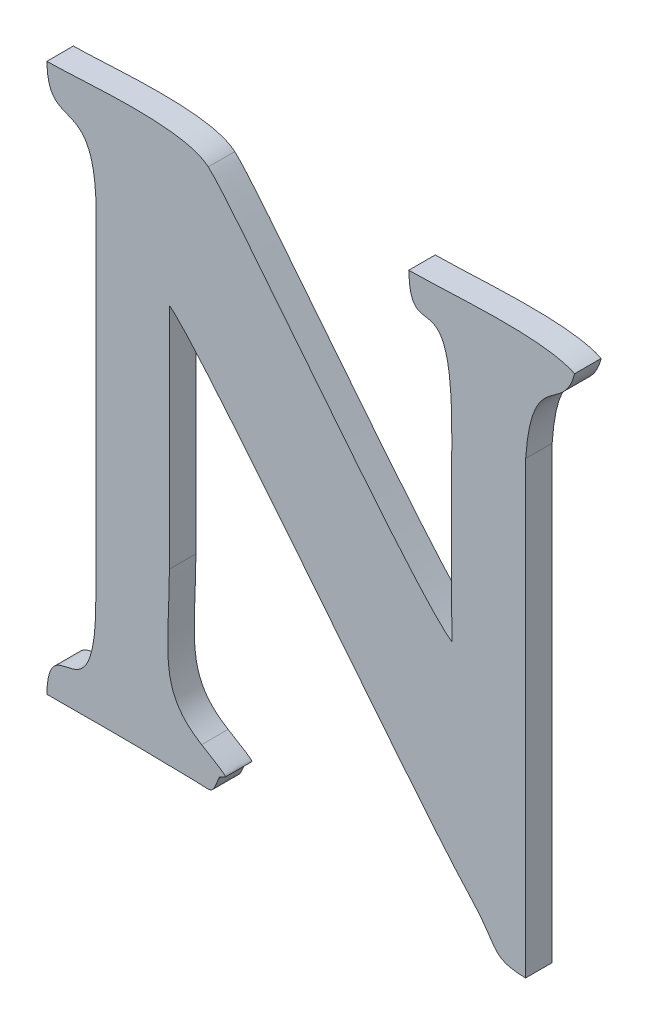
ISO-10303-21;
HEADER;
FILE_DESCRIPTION(('STEP AP214'),'2;1');
FILE_NAME('part.step','',(''),(''),'','','');
FILE_SCHEMA(('AUTOMOTIVE_DESIGN { 1 0 10303 214 1 1 1 1 }'));
ENDSEC;
DATA;
#1=APPLICATION_CONTEXT('core data for automotive mechanical design processes');
#2=APPLICATION_PROTOCOL_DEFINITION('international standard','automotive_design',2000,#1);
#3=PRODUCT_CONTEXT('',#1,'mechanical');
#4=PRODUCT('Part','Part','',(#3));
#5=PRODUCT_RELATED_PRODUCT_CATEGORY('part','',(#4));
#6=PRODUCT_DEFINITION_FORMATION('','',#4);
#7=PRODUCT_DEFINITION_CONTEXT('part definition',#1,'design');
#8=PRODUCT_DEFINITION('design','',#6,#7);
#9=PRODUCT_DEFINITION_SHAPE('','',#8);
#10=(LENGTH_UNIT() NAMED_UNIT(*) SI_UNIT(.MILLI.,.METRE.));
#11=(NAMED_UNIT(*) PLANE_ANGLE_UNIT() SI_UNIT($,.RADIAN.));
#12=(NAMED_UNIT(*) SI_UNIT($,.STERADIAN.) SOLID_ANGLE_UNIT());
#13=UNCERTAINTY_MEASURE_WITH_UNIT(LENGTH_MEASURE(1.E-05),#10,'distance_accuracy_value','');
#14=(GEOMETRIC_REPRESENTATION_CONTEXT(3) GLOBAL_UNCERTAINTY_ASSIGNED_CONTEXT((#13)) GLOBAL_UNIT_ASSIGNED_CONTEXT((#10,
#11,#12)) REPRESENTATION_CONTEXT('',''));
#15=CARTESIAN_POINT('',(0.,0.,0.));
#16=DIRECTION('',(0.,0.,1.));
#17=DIRECTION('',(1.,0.,0.));
#18=AXIS2_PLACEMENT_3D('',#15,#16,#17);
#19=CARTESIAN_POINT('',(50.2821299999998,11.219925,0.001));
#20=CARTESIAN_POINT('',(50.2821299999998,11.219925,0.));
#21=CARTESIAN_POINT('',(50.2821999999998,11.217251,0.001));
#22=CARTESIAN_POINT('',(50.2821999999998,11.217251,0.));
#23=CARTESIAN_POINT('',(50.2837959999998,11.220821,0.001));
#24=CARTESIAN_POINT('',(50.2837959999998,11.220821,0.));
#25=CARTESIAN_POINT('',(50.2837539999998,11.215249,0.001));
#26=CARTESIAN_POINT('',(50.2837539999998,11.215249,0.));
#27=B_SPLINE_SURFACE_WITH_KNOTS('',3,1,((#19,#20),(#21,#22),(#23,#24),(#25,#26)),.UNSPECIFIED.,
.F.,.F.,.F.,(4,4),(2,2),(0.842105263157895,0.894736842105263),(0.,1.),.UNSPECIFIED.);
#28=CARTESIAN_POINT('',(50.2821299999998,11.219925,0.));
#29=CARTESIAN_POINT('',(50.2821999999998,11.217251,0.));
#30=CARTESIAN_POINT('',(50.2837959999998,11.220821,0.));
#31=CARTESIAN_POINT('',(50.2837539999998,11.215249,0.));
#32=B_SPLINE_CURVE_WITH_KNOTS('',3,(#28,#29,#30,#31),.UNSPECIFIED.,.F.,.F.,(4,4),
(0.842105263157895,0.894736842105263),.UNSPECIFIED.);
#33=CARTESIAN_POINT('',(50.2821299999998,11.219925,0.));
#34=VERTEX_POINT('',#33);
#35=CARTESIAN_POINT('',(50.2837539999998,11.215249,0.));
#36=VERTEX_POINT('',#35);
#37=EDGE_CURVE('E11',#34,#36,#32,.T.);
#38=DIRECTION('',(0.,0.,-1.));
#39=VECTOR('',#38,1.);
#40=CARTESIAN_POINT('',(50.2837539999998,11.215249,0.001));
#41=LINE('',#40,#39);
#42=CARTESIAN_POINT('',(50.2837539999998,11.215249,0.001));
#43=VERTEX_POINT('',#42);
#44=EDGE_CURVE('E28',#43,#36,#41,.T.);
#45=CARTESIAN_POINT('',(50.2821299999998,11.219925,0.001));
#46=CARTESIAN_POINT('',(50.2821999999998,11.217251,0.001));
#47=CARTESIAN_POINT('',(50.2837959999998,11.220821,0.001));
#48=CARTESIAN_POINT('',(50.2837539999998,11.215249,0.001));
#49=B_SPLINE_CURVE_WITH_KNOTS('',3,(#45,#46,#47,#48),.UNSPECIFIED.,.F.,.F.,(4,4),
(0.842105263157895,0.894736842105263),.UNSPECIFIED.);
#50=CARTESIAN_POINT('',(50.2821299999998,11.219925,0.001));
#51=VERTEX_POINT('',#50);
#52=EDGE_CURVE('E407',#51,#43,#49,.T.);
#53=DIRECTION('',(0.,0.,-1.));
#54=VECTOR('',#53,1.);
#55=CARTESIAN_POINT('',(50.2821299999998,11.219925,0.001));
#56=LINE('',#55,#54);
#57=EDGE_CURVE('E40',#51,#34,#56,.T.);
#58=ORIENTED_EDGE('',*,*,#37,.T.);
#59=ORIENTED_EDGE('',*,*,#44,.F.);
#60=ORIENTED_EDGE('',*,*,#52,.F.);
#61=ORIENTED_EDGE('',*,*,#57,.T.);
#62=EDGE_LOOP('',(#58,#59,#60,#61));
#63=FACE_BOUND('',#62,.T.);
#64=ADVANCED_FACE('F17',(#63),#27,.F.);
#65=CARTESIAN_POINT('',(50.2837539999998,11.215249,0.001));
#66=CARTESIAN_POINT('',(50.2837539999998,11.215249,0.));
#67=CARTESIAN_POINT('',(50.2837399999998,11.213037,0.001));
#68=CARTESIAN_POINT('',(50.2837399999998,11.213037,0.));
#69=CARTESIAN_POINT('',(50.2837539999998,11.210811,0.001));
#70=CARTESIAN_POINT('',(50.2837539999998,11.210811,0.));
#71=CARTESIAN_POINT('',(50.2837539999998,11.208599,0.001));
#72=CARTESIAN_POINT('',(50.2837539999998,11.208599,0.));
#73=B_SPLINE_SURFACE_WITH_KNOTS('',3,1,((#65,#66),(#67,#68),(#69,#70),(#71,#72)),.UNSPECIFIED.,
.F.,.F.,.F.,(4,4),(2,2),(0.894736842105263,1.),(0.,1.),.UNSPECIFIED.);
#74=CARTESIAN_POINT('',(50.2837539999998,11.215249,0.));
#75=CARTESIAN_POINT('',(50.2837399999998,11.213037,0.));
#76=CARTESIAN_POINT('',(50.2837539999998,11.210811,0.));
#77=CARTESIAN_POINT('',(50.2837539999998,11.208599,0.));
#78=B_SPLINE_CURVE_WITH_KNOTS('',3,(#74,#75,#76,#77),.UNSPECIFIED.,.F.,.F.,(4,4),
(0.894736842105263,1.),.UNSPECIFIED.);
#79=CARTESIAN_POINT('',(50.2837539999998,11.208599,0.));
#80=VERTEX_POINT('',#79);
#81=EDGE_CURVE('E399',#36,#80,#78,.T.);
#82=DIRECTION('',(0.,0.,-1.));
#83=VECTOR('',#82,1.);
#84=CARTESIAN_POINT('',(50.2837539999998,11.208599,0.001));
#85=LINE('',#84,#83);
#86=CARTESIAN_POINT('',(50.2837539999998,11.208599,0.001));
#87=VERTEX_POINT('',#86);
#88=EDGE_CURVE('E394',#87,#80,#85,.T.);
#89=CARTESIAN_POINT('',(50.2837539999998,11.215249,0.001));
#90=CARTESIAN_POINT('',(50.2837399999998,11.213037,0.001));
#91=CARTESIAN_POINT('',(50.2837539999998,11.210811,0.001));
#92=CARTESIAN_POINT('',(50.2837539999998,11.208599,0.001));
#93=B_SPLINE_CURVE_WITH_KNOTS('',3,(#89,#90,#91,#92),.UNSPECIFIED.,.F.,.F.,(4,4),
(0.894736842105263,1.),.UNSPECIFIED.);
#94=EDGE_CURVE('E387',#43,#87,#93,.T.);
#95=ORIENTED_EDGE('',*,*,#81,.T.);
#96=ORIENTED_EDGE('',*,*,#88,.F.);
#97=ORIENTED_EDGE('',*,*,#94,.F.);
#98=ORIENTED_EDGE('',*,*,#44,.T.);
#99=EDGE_LOOP('',(#95,#96,#97,#98));
#100=FACE_BOUND('',#99,.T.);
#101=ADVANCED_FACE('F415',(#100),#73,.F.);
#102=CARTESIAN_POINT('',(50.2837539999998,11.208599,0.001));
#103=CARTESIAN_POINT('',(50.2837539999998,11.208599,0.));
#104=CARTESIAN_POINT('',(50.2822279999998,11.209677,0.001));
#105=CARTESIAN_POINT('',(50.2822279999998,11.209677,0.));
#106=CARTESIAN_POINT('',(50.2755639999998,11.218665,0.001));
#107=CARTESIAN_POINT('',(50.2755639999998,11.218665,0.));
#108=CARTESIAN_POINT('',(50.2745699999998,11.219519,0.001));
#109=CARTESIAN_POINT('',(50.2745699999998,11.219519,0.));
#110=B_SPLINE_SURFACE_WITH_KNOTS('',3,1,((#102,#103),(#104,#105),(#106,#107),(#108,#109)),
.UNSPECIFIED.,.F.,.F.,.F.,(4,4),(2,2),(0.,0.0526315789473684),(0.,1.),.UNSPECIFIED.);
#111=CARTESIAN_POINT('',(50.2837539999998,11.208599,0.));
#112=CARTESIAN_POINT('',(50.2822279999998,11.209677,0.));
#113=CARTESIAN_POINT('',(50.2755639999998,11.218665,0.));
#114=CARTESIAN_POINT('',(50.2745699999998,11.219519,0.));
#115=B_SPLINE_CURVE_WITH_KNOTS('',3,(#111,#112,#113,#114),.UNSPECIFIED.,.F.,.F.,(4,4),(0.,
0.0526315789473684),.UNSPECIFIED.);
#116=CARTESIAN_POINT('',(50.2745699999998,11.219519,0.));
#117=VERTEX_POINT('',#116);
#118=EDGE_CURVE('E382',#80,#117,#115,.T.);
#119=DIRECTION('',(0.,0.,-1.));
#120=VECTOR('',#119,1.);
#121=CARTESIAN_POINT('',(50.2745699999998,11.219519,0.001));
#122=LINE('',#121,#120);
#123=CARTESIAN_POINT('',(50.2745699999998,11.219519,0.001));
#124=VERTEX_POINT('',#123);
#125=EDGE_CURVE('E377',#124,#117,#122,.T.);
#126=CARTESIAN_POINT('',(50.2837539999998,11.208599,0.001));
#127=CARTESIAN_POINT('',(50.2822279999998,11.209677,0.001));
#128=CARTESIAN_POINT('',(50.2755639999998,11.218665,0.001));
#129=CARTESIAN_POINT('',(50.2745699999998,11.219519,0.001));
#130=B_SPLINE_CURVE_WITH_KNOTS('',3,(#126,#127,#128,#129),.UNSPECIFIED.,.F.,.F.,(4,4),(0.,
0.0526315789473684),.UNSPECIFIED.);
#131=EDGE_CURVE('E370',#87,#124,#130,.T.);
#132=ORIENTED_EDGE('',*,*,#118,.T.);
#133=ORIENTED_EDGE('',*,*,#125,.F.);
#134=ORIENTED_EDGE('',*,*,#131,.F.);
#135=ORIENTED_EDGE('',*,*,#88,.T.);
#136=EDGE_LOOP('',(#132,#133,#134,#135));
#137=FACE_BOUND('',#136,.T.);
#138=ADVANCED_FACE('F420',(#137),#110,.F.);
#139=CARTESIAN_POINT('',(50.2745699999998,11.219519,0.000999999999999998));
#140=CARTESIAN_POINT('',(50.2745699999998,11.219519,0.));
#141=CARTESIAN_POINT('',(50.2735899999998,11.220359,0.000999999999999998));
#142=CARTESIAN_POINT('',(50.2735899999998,11.220359,0.));
#143=CARTESIAN_POINT('',(50.2699219999998,11.219925,0.000999999999999998));
#144=CARTESIAN_POINT('',(50.2699219999998,11.219925,0.));
#145=CARTESIAN_POINT('',(50.2684799999998,11.219925,0.000999999999999998));
#146=CARTESIAN_POINT('',(50.2684799999998,11.219925,0.));
#147=B_SPLINE_SURFACE_WITH_KNOTS('',3,1,((#139,#140),(#141,#142),(#143,#144),(#145,#146)),
.UNSPECIFIED.,.F.,.F.,.F.,(4,4),(2,2),(0.0526315789473684,0.105263157894737),(0.,1.),.UNSPECIFIED.);
#148=CARTESIAN_POINT('',(50.2745699999998,11.219519,0.));
#149=CARTESIAN_POINT('',(50.2735899999998,11.220359,0.));
#150=CARTESIAN_POINT('',(50.2699219999998,11.219925,0.));
#151=CARTESIAN_POINT('',(50.2684799999998,11.219925,0.));
#152=B_SPLINE_CURVE_WITH_KNOTS('',3,(#148,#149,#150,#151),.UNSPECIFIED.,.F.,.F.,(4,4),
(0.0526315789473684,0.105263157894737),.UNSPECIFIED.);
#153=CARTESIAN_POINT('',(50.2684799999998,11.219925,0.));
#154=VERTEX_POINT('',#153);
#155=EDGE_CURVE('E365',#117,#154,#152,.T.);
#156=DIRECTION('',(0.,0.,-1.));
#157=VECTOR('',#156,1.);
#158=CARTESIAN_POINT('',(50.2684799999998,11.219925,0.000999999999999998));
#159=LINE('',#158,#157);
#160=CARTESIAN_POINT('',(50.2684799999998,11.219925,0.000999999999999998));
#161=VERTEX_POINT('',#160);
#162=EDGE_CURVE('E360',#161,#154,#159,.T.);
#163=CARTESIAN_POINT('',(50.2745699999998,11.219519,0.001));
#164=CARTESIAN_POINT('',(50.2735899999998,11.220359,0.000999999999999998));
#165=CARTESIAN_POINT('',(50.2699219999998,11.219925,0.000999999999999998));
#166=CARTESIAN_POINT('',(50.2684799999998,11.219925,0.000999999999999998));
#167=B_SPLINE_CURVE_WITH_KNOTS('',3,(#163,#164,#165,#166),.UNSPECIFIED.,.F.,.F.,(4,4),
(0.0526315789473684,0.105263157894737),.UNSPECIFIED.);
#168=EDGE_CURVE('E353',#124,#161,#167,.T.);
#169=ORIENTED_EDGE('',*,*,#155,.T.);
#170=ORIENTED_EDGE('',*,*,#162,.F.);
#171=ORIENTED_EDGE('',*,*,#168,.F.);
#172=ORIENTED_EDGE('',*,*,#125,.T.);
#173=EDGE_LOOP('',(#169,#170,#171,#172));
#174=FACE_BOUND('',#173,.T.);
#175=ADVANCED_FACE('F426',(#174),#147,.F.);
#176=CARTESIAN_POINT('',(50.2684799999998,11.219925,0.001));
#177=CARTESIAN_POINT('',(50.2684799999998,11.219925,0.));
#178=CARTESIAN_POINT('',(50.2685219999998,11.217503,0.001));
#179=CARTESIAN_POINT('',(50.2685219999998,11.217503,0.));
#180=CARTESIAN_POINT('',(50.2703559999998,11.219953,0.001));
#181=CARTESIAN_POINT('',(50.2703559999998,11.219953,0.));
#182=CARTESIAN_POINT('',(50.2703419999998,11.215753,0.001));
#183=CARTESIAN_POINT('',(50.2703419999998,11.215753,0.));
#184=B_SPLINE_SURFACE_WITH_KNOTS('',3,1,((#176,#177),(#178,#179),(#180,#181),(#182,#183)),
.UNSPECIFIED.,.F.,.F.,.F.,(4,4),(2,2),(0.105263157894737,0.157894736842105),(0.,1.),.UNSPECIFIED.);
#185=CARTESIAN_POINT('',(50.2684799999998,11.219925,0.));
#186=CARTESIAN_POINT('',(50.2685219999998,11.217503,0.));
#187=CARTESIAN_POINT('',(50.2703559999998,11.219953,0.));
#188=CARTESIAN_POINT('',(50.2703419999998,11.215753,0.));
#189=B_SPLINE_CURVE_WITH_KNOTS('',3,(#185,#186,#187,#188),.UNSPECIFIED.,.F.,.F.,(4,4),
(0.105263157894737,0.157894736842105),.UNSPECIFIED.);
#190=CARTESIAN_POINT('',(50.2703419999998,11.215753,0.));
#191=VERTEX_POINT('',#190);
#192=EDGE_CURVE('E348',#154,#191,#189,.T.);
#193=DIRECTION('',(0.,0.,-1.));
#194=VECTOR('',#193,1.);
#195=CARTESIAN_POINT('',(50.2703419999998,11.215753,0.001));
#196=LINE('',#195,#194);
#197=CARTESIAN_POINT('',(50.2703419999998,11.215753,0.001));
#198=VERTEX_POINT('',#197);
#199=EDGE_CURVE('E343',#198,#191,#196,.T.);
#200=CARTESIAN_POINT('',(50.2684799999998,11.219925,0.000999999999999998));
#201=CARTESIAN_POINT('',(50.2685219999998,11.217503,0.001));
#202=CARTESIAN_POINT('',(50.2703559999998,11.219953,0.001));
#203=CARTESIAN_POINT('',(50.2703419999998,11.215753,0.001));
#204=B_SPLINE_CURVE_WITH_KNOTS('',3,(#200,#201,#202,#203),.UNSPECIFIED.,.F.,.F.,(4,4),
(0.105263157894737,0.157894736842105),.UNSPECIFIED.);
#205=EDGE_CURVE('E339',#161,#198,#204,.T.);
#206=ORIENTED_EDGE('',*,*,#192,.T.);
#207=ORIENTED_EDGE('',*,*,#199,.F.);
#208=ORIENTED_EDGE('',*,*,#205,.F.);
#209=ORIENTED_EDGE('',*,*,#162,.T.);
#210=EDGE_LOOP('',(#206,#207,#208,#209));
#211=FACE_BOUND('',#210,.T.);
#212=ADVANCED_FACE('F430',(#211),#184,.F.);
#213=CARTESIAN_POINT('',(50.2575319274578,-0.0571108317623086,0.001));
#214=DIRECTION('',(0.999999354339468,-0.001136362903187,0.));
#215=DIRECTION('',(0.001136362903187,0.999999354339468,0.));
#216=AXIS2_PLACEMENT_3D('',#213,#214,#215);
#217=PLANE('',#216);
#218=DIRECTION('',(-0.001136362903187,-0.999999354339468,0.));
#219=VECTOR('',#218,1.);
#220=CARTESIAN_POINT('',(50.2575319274578,-0.0571108317623086,0.));
#221=LINE('',#220,#219);
#222=CARTESIAN_POINT('',(50.2703279999998,11.203433,0.));
#223=VERTEX_POINT('',#222);
#224=EDGE_CURVE('E337',#191,#223,#221,.T.);
#225=ORIENTED_EDGE('',*,*,#224,.T.);
#226=DIRECTION('',(0.,0.,-1.));
#227=VECTOR('',#226,1.);
#228=CARTESIAN_POINT('',(50.2703279999998,11.203433,0.001));
#229=LINE('',#228,#227);
#230=CARTESIAN_POINT('',(50.2703279999998,11.203433,0.001));
#231=VERTEX_POINT('',#230);
#232=EDGE_CURVE('E334',#231,#223,#229,.T.);
#233=ORIENTED_EDGE('',*,*,#232,.F.);
#234=DIRECTION('',(-0.001136362903187,-0.999999354339468,0.));
#235=VECTOR('',#234,1.);
#236=CARTESIAN_POINT('',(50.2575319274578,-0.0571108317623086,0.001));
#237=LINE('',#236,#235);
#238=EDGE_CURVE('E328',#198,#231,#237,.T.);
#239=ORIENTED_EDGE('',*,*,#238,.F.);
#240=ORIENTED_EDGE('',*,*,#199,.T.);
#241=EDGE_LOOP('',(#225,#233,#239,#240));
#242=FACE_BOUND('',#241,.T.);
#243=ADVANCED_FACE('F434',(#242),#217,.F.);
#244=CARTESIAN_POINT('',(50.2703279999998,11.203433,0.001));
#245=CARTESIAN_POINT('',(50.2703279999998,11.203433,0.));
#246=CARTESIAN_POINT('',(50.2703699999998,11.198743,0.001));
#247=CARTESIAN_POINT('',(50.2703699999998,11.198743,0.));
#248=CARTESIAN_POINT('',(50.2685359999998,11.201851,0.001));
#249=CARTESIAN_POINT('',(50.2685359999998,11.201851,0.));
#250=CARTESIAN_POINT('',(50.2684799999998,11.199247,0.001));
#251=CARTESIAN_POINT('',(50.2684799999998,11.199247,0.));
#252=B_SPLINE_SURFACE_WITH_KNOTS('',3,1,((#244,#245),(#246,#247),(#248,#249),(#250,#251)),
.UNSPECIFIED.,.F.,.F.,.F.,(4,4),(2,2),(0.210526315789474,0.263157894736842),(0.,1.),.UNSPECIFIED.);
#253=CARTESIAN_POINT('',(50.2703279999998,11.203433,0.));
#254=CARTESIAN_POINT('',(50.2703699999998,11.198743,0.));
#255=CARTESIAN_POINT('',(50.2685359999998,11.201851,0.));
#256=CARTESIAN_POINT('',(50.2684799999998,11.199247,0.));
#257=B_SPLINE_CURVE_WITH_KNOTS('',3,(#253,#254,#255,#256),.UNSPECIFIED.,.F.,.F.,(4,4),
(0.210526315789474,0.263157894736842),.UNSPECIFIED.);
#258=CARTESIAN_POINT('',(50.2684799999998,11.199247,0.));
#259=VERTEX_POINT('',#258);
#260=EDGE_CURVE('E323',#223,#259,#257,.T.);
#261=DIRECTION('',(0.,0.,-1.));
#262=VECTOR('',#261,1.);
#263=CARTESIAN_POINT('',(50.2684799999998,11.199247,0.001));
#264=LINE('',#263,#262);
#265=CARTESIAN_POINT('',(50.2684799999998,11.199247,0.001));
#266=VERTEX_POINT('',#265);
#267=EDGE_CURVE('E318',#266,#259,#264,.T.);
#268=CARTESIAN_POINT('',(50.2703279999998,11.203433,0.001));
#269=CARTESIAN_POINT('',(50.2703699999998,11.198743,0.001));
#270=CARTESIAN_POINT('',(50.2685359999998,11.201851,0.001));
#271=CARTESIAN_POINT('',(50.2684799999998,11.199247,0.001));
#272=B_SPLINE_CURVE_WITH_KNOTS('',3,(#268,#269,#270,#271),.UNSPECIFIED.,.F.,.F.,(4,4),
(0.210526315789474,0.263157894736842),.UNSPECIFIED.);
#273=EDGE_CURVE('E311',#231,#266,#272,.T.);
#274=ORIENTED_EDGE('',*,*,#260,.T.);
#275=ORIENTED_EDGE('',*,*,#267,.F.);
#276=ORIENTED_EDGE('',*,*,#273,.F.);
#277=ORIENTED_EDGE('',*,*,#232,.T.);
#278=EDGE_LOOP('',(#274,#275,#276,#277));
#279=FACE_BOUND('',#278,.T.);
#280=ADVANCED_FACE('F438',(#279),#252,.F.);
#281=CARTESIAN_POINT('',(50.2684799999998,11.199247,0.001));
#282=CARTESIAN_POINT('',(50.2684799999998,11.199247,0.));
#283=CARTESIAN_POINT('',(50.2696279999998,11.199247,0.001));
#284=CARTESIAN_POINT('',(50.2696279999998,11.199247,0.));
#285=CARTESIAN_POINT('',(50.2707899999998,11.199261,0.001));
#286=CARTESIAN_POINT('',(50.2707899999998,11.199261,0.));
#287=CARTESIAN_POINT('',(50.2719519999998,11.199247,0.001));
#288=CARTESIAN_POINT('',(50.2719519999998,11.199247,0.));
#289=B_SPLINE_SURFACE_WITH_KNOTS('',3,1,((#281,#282),(#283,#284),(#285,#286),(#287,#288)),
.UNSPECIFIED.,.F.,.F.,.F.,(4,4),(2,2),(0.263157894736842,0.315789473684211),(0.,1.),.UNSPECIFIED.);
#290=CARTESIAN_POINT('',(50.2684799999998,11.199247,0.));
#291=CARTESIAN_POINT('',(50.2696279999998,11.199247,0.));
#292=CARTESIAN_POINT('',(50.2707899999998,11.199261,0.));
#293=CARTESIAN_POINT('',(50.2719519999998,11.199247,0.));
#294=B_SPLINE_CURVE_WITH_KNOTS('',3,(#290,#291,#292,#293),.UNSPECIFIED.,.F.,.F.,(4,4),
(0.263157894736842,0.315789473684211),.UNSPECIFIED.);
#295=CARTESIAN_POINT('',(50.2719519999998,11.199247,0.));
#296=VERTEX_POINT('',#295);
#297=EDGE_CURVE('E306',#259,#296,#294,.T.);
#298=DIRECTION('',(0.,0.,-1.));
#299=VECTOR('',#298,1.);
#300=CARTESIAN_POINT('',(50.2719519999998,11.199247,0.001));
#301=LINE('',#300,#299);
#302=CARTESIAN_POINT('',(50.2719519999998,11.199247,0.001));
#303=VERTEX_POINT('',#302);
#304=EDGE_CURVE('E301',#303,#296,#301,.T.);
#305=CARTESIAN_POINT('',(50.2684799999998,11.199247,0.001));
#306=CARTESIAN_POINT('',(50.2696279999998,11.199247,0.001));
#307=CARTESIAN_POINT('',(50.2707899999998,11.199261,0.001));
#308=CARTESIAN_POINT('',(50.2719519999998,11.199247,0.001));
#309=B_SPLINE_CURVE_WITH_KNOTS('',3,(#305,#306,#307,#308),.UNSPECIFIED.,.F.,.F.,(4,4),
(0.263157894736842,0.315789473684211),.UNSPECIFIED.);
#310=EDGE_CURVE('E297',#266,#303,#309,.T.);
#311=ORIENTED_EDGE('',*,*,#297,.T.);
#312=ORIENTED_EDGE('',*,*,#304,.F.);
#313=ORIENTED_EDGE('',*,*,#310,.F.);
#314=ORIENTED_EDGE('',*,*,#267,.T.);
#315=EDGE_LOOP('',(#311,#312,#313,#314));
#316=FACE_BOUND('',#315,.T.);
#317=ADVANCED_FACE('F444',(#316),#289,.F.);
#318=CARTESIAN_POINT('',(0.206069641894335,12.0550740489866,0.001));
#319=DIRECTION('',(0.0170915201615882,0.999853929300959,0.));
#320=DIRECTION('',(-0.999853929300959,0.0170915201615882,0.));
#321=AXIS2_PLACEMENT_3D('',#318,#319,#320);
#322=PLANE('',#321);
#323=DIRECTION('',(0.999853929300959,-0.0170915201615882,0.));
#324=VECTOR('',#323,1.);
#325=CARTESIAN_POINT('',(0.206069641894335,12.0550740489866,0.));
#326=LINE('',#325,#324);
#327=CARTESIAN_POINT('',(50.2735899999998,11.199219,0.));
#328=VERTEX_POINT('',#327);
#329=EDGE_CURVE('E295',#296,#328,#326,.T.);
#330=ORIENTED_EDGE('',*,*,#329,.T.);
#331=DIRECTION('',(0.,0.,-1.));
#332=VECTOR('',#331,1.);
#333=CARTESIAN_POINT('',(50.2735899999998,11.199219,0.001));
#334=LINE('',#333,#332);
#335=CARTESIAN_POINT('',(50.2735899999998,11.199219,0.001));
#336=VERTEX_POINT('',#335);
#337=EDGE_CURVE('E292',#336,#328,#334,.T.);
#338=ORIENTED_EDGE('',*,*,#337,.F.);
#339=DIRECTION('',(0.999853929300959,-0.0170915201615882,0.));
#340=VECTOR('',#339,1.);
#341=CARTESIAN_POINT('',(0.206069641894335,12.0550740489866,0.001));
#342=LINE('',#341,#340);
#343=EDGE_CURVE('E286',#303,#336,#342,.T.);
#344=ORIENTED_EDGE('',*,*,#343,.F.);
#345=ORIENTED_EDGE('',*,*,#304,.T.);
#346=EDGE_LOOP('',(#330,#338,#344,#345));
#347=FACE_BOUND('',#346,.T.);
#348=ADVANCED_FACE('F482',(#347),#322,.F.);
#349=CARTESIAN_POINT('',(50.2735899999998,11.199219,0.001));
#350=CARTESIAN_POINT('',(50.2735899999998,11.199219,0.));
#351=CARTESIAN_POINT('',(50.2748079999998,11.199233,0.001));
#352=CARTESIAN_POINT('',(50.2748079999998,11.199233,0.));
#353=CARTESIAN_POINT('',(50.2746539999998,11.198981,0.001));
#354=CARTESIAN_POINT('',(50.2746539999998,11.198981,0.));
#355=CARTESIAN_POINT('',(50.2749619999998,11.199737,0.001));
#356=CARTESIAN_POINT('',(50.2749619999998,11.199737,0.));
#357=B_SPLINE_SURFACE_WITH_KNOTS('',3,1,((#349,#350),(#351,#352),(#353,#354),(#355,#356)),
.UNSPECIFIED.,.F.,.F.,.F.,(4,4),(2,2),(0.368421052631579,0.421052631578947),(0.,1.),.UNSPECIFIED.);
#358=CARTESIAN_POINT('',(50.2735899999998,11.199219,0.));
#359=CARTESIAN_POINT('',(50.2748079999998,11.199233,0.));
#360=CARTESIAN_POINT('',(50.2746539999998,11.198981,0.));
#361=CARTESIAN_POINT('',(50.2749619999998,11.199737,0.));
#362=B_SPLINE_CURVE_WITH_KNOTS('',3,(#358,#359,#360,#361),.UNSPECIFIED.,.F.,.F.,(4,4),
(0.368421052631579,0.421052631578947),.UNSPECIFIED.);
#363=CARTESIAN_POINT('',(50.2749619999998,11.199737,0.));
#364=VERTEX_POINT('',#363);
#365=EDGE_CURVE('E281',#328,#364,#362,.T.);
#366=DIRECTION('',(0.,0.,-1.));
#367=VECTOR('',#366,1.);
#368=CARTESIAN_POINT('',(50.2749619999998,11.199737,0.001));
#369=LINE('',#368,#367);
#370=CARTESIAN_POINT('',(50.2749619999998,11.199737,0.001));
#371=VERTEX_POINT('',#370);
#372=EDGE_CURVE('E276',#371,#364,#369,.T.);
#373=CARTESIAN_POINT('',(50.2735899999998,11.199219,0.001));
#374=CARTESIAN_POINT('',(50.2748079999998,11.199233,0.001));
#375=CARTESIAN_POINT('',(50.2746539999998,11.198981,0.001));
#376=CARTESIAN_POINT('',(50.2749619999998,11.199737,0.001));
#377=B_SPLINE_CURVE_WITH_KNOTS('',3,(#373,#374,#375,#376),.UNSPECIFIED.,.F.,.F.,(4,4),
(0.368421052631579,0.421052631578947),.UNSPECIFIED.);
#378=EDGE_CURVE('E269',#336,#371,#377,.T.);
#379=ORIENTED_EDGE('',*,*,#365,.T.);
#380=ORIENTED_EDGE('',*,*,#372,.F.);
#381=ORIENTED_EDGE('',*,*,#378,.F.);
#382=ORIENTED_EDGE('',*,*,#337,.T.);
#383=EDGE_LOOP('',(#379,#380,#381,#382));
#384=FACE_BOUND('',#383,.T.);
#385=ADVANCED_FACE('F450',(#384),#357,.F.);
#386=CARTESIAN_POINT('',(50.2749619999998,11.199737,0.000999999999999998));
#387=CARTESIAN_POINT('',(50.2749619999998,11.199737,0.));
#388=CARTESIAN_POINT('',(50.2750739999998,11.200031,0.000999999999999998));
#389=CARTESIAN_POINT('',(50.2750739999998,11.200031,0.));
#390=CARTESIAN_POINT('',(50.2757319999998,11.199667,0.000999999999999998));
#391=CARTESIAN_POINT('',(50.2757319999998,11.199667,0.));
#392=CARTESIAN_POINT('',(50.2743179999998,11.200521,0.000999999999999998));
#393=CARTESIAN_POINT('',(50.2743179999998,11.200521,0.));
#394=B_SPLINE_SURFACE_WITH_KNOTS('',3,1,((#386,#387),(#388,#389),(#390,#391),(#392,#393)),
.UNSPECIFIED.,.F.,.F.,.F.,(4,4),(2,2),(0.421052631578947,0.473684210526316),(0.,1.),.UNSPECIFIED.);
#395=CARTESIAN_POINT('',(50.2749619999998,11.199737,0.));
#396=CARTESIAN_POINT('',(50.2750739999998,11.200031,0.));
#397=CARTESIAN_POINT('',(50.2757319999998,11.199667,0.));
#398=CARTESIAN_POINT('',(50.2743179999998,11.200521,0.));
#399=B_SPLINE_CURVE_WITH_KNOTS('',3,(#395,#396,#397,#398),.UNSPECIFIED.,.F.,.F.,(4,4),
(0.421052631578947,0.473684210526316),.UNSPECIFIED.);
#400=CARTESIAN_POINT('',(50.2743179999998,11.200521,0.));
#401=VERTEX_POINT('',#400);
#402=EDGE_CURVE('E264',#364,#401,#399,.T.);
#403=DIRECTION('',(0.,0.,-1.));
#404=VECTOR('',#403,1.);
#405=CARTESIAN_POINT('',(50.2743179999998,11.200521,0.000999999999999998));
#406=LINE('',#405,#404);
#407=CARTESIAN_POINT('',(50.2743179999998,11.200521,0.000999999999999998));
#408=VERTEX_POINT('',#407);
#409=EDGE_CURVE('E259',#408,#401,#406,.T.);
#410=CARTESIAN_POINT('',(50.2749619999998,11.199737,0.001));
#411=CARTESIAN_POINT('',(50.2750739999998,11.200031,0.000999999999999998));
#412=CARTESIAN_POINT('',(50.2757319999998,11.199667,0.000999999999999998));
#413=CARTESIAN_POINT('',(50.2743179999998,11.200521,0.000999999999999998));
#414=B_SPLINE_CURVE_WITH_KNOTS('',3,(#410,#411,#412,#413),.UNSPECIFIED.,.F.,.F.,(4,4),
(0.421052631578947,0.473684210526316),.UNSPECIFIED.);
#415=EDGE_CURVE('E252',#371,#408,#414,.T.);
#416=ORIENTED_EDGE('',*,*,#402,.T.);
#417=ORIENTED_EDGE('',*,*,#409,.F.);
#418=ORIENTED_EDGE('',*,*,#415,.F.);
#419=ORIENTED_EDGE('',*,*,#372,.T.);
#420=EDGE_LOOP('',(#416,#417,#418,#419));
#421=FACE_BOUND('',#420,.T.);
#422=ADVANCED_FACE('F456',(#421),#394,.F.);
#423=CARTESIAN_POINT('',(50.2743179999998,11.200521,0.001));
#424=CARTESIAN_POINT('',(50.2743179999998,11.200521,0.));
#425=CARTESIAN_POINT('',(50.2726239999998,11.201529,0.001));
#426=CARTESIAN_POINT('',(50.2726239999998,11.201529,0.));
#427=CARTESIAN_POINT('',(50.2730999999998,11.202985,0.001));
#428=CARTESIAN_POINT('',(50.2730999999998,11.202985,0.));
#429=CARTESIAN_POINT('',(50.2730999999998,11.205645,0.001));
#430=CARTESIAN_POINT('',(50.2730999999998,11.205645,0.));
#431=B_SPLINE_SURFACE_WITH_KNOTS('',3,1,((#423,#424),(#425,#426),(#427,#428),(#429,#430)),
.UNSPECIFIED.,.F.,.F.,.F.,(4,4),(2,2),(0.473684210526316,0.526315789473684),(0.,1.),.UNSPECIFIED.);
#432=CARTESIAN_POINT('',(50.2743179999998,11.200521,0.));
#433=CARTESIAN_POINT('',(50.2726239999998,11.201529,0.));
#434=CARTESIAN_POINT('',(50.2730999999998,11.202985,0.));
#435=CARTESIAN_POINT('',(50.2730999999998,11.205645,0.));
#436=B_SPLINE_CURVE_WITH_KNOTS('',3,(#432,#433,#434,#435),.UNSPECIFIED.,.F.,.F.,(4,4),
(0.473684210526316,0.526315789473684),.UNSPECIFIED.);
#437=CARTESIAN_POINT('',(50.2730999999998,11.205645,0.));
#438=VERTEX_POINT('',#437);
#439=EDGE_CURVE('E247',#401,#438,#436,.T.);
#440=DIRECTION('',(0.,0.,-1.));
#441=VECTOR('',#440,1.);
#442=CARTESIAN_POINT('',(50.2730999999998,11.205645,0.001));
#443=LINE('',#442,#441);
#444=CARTESIAN_POINT('',(50.2730999999998,11.205645,0.001));
#445=VERTEX_POINT('',#444);
#446=EDGE_CURVE('E242',#445,#438,#443,.T.);
#447=CARTESIAN_POINT('',(50.2743179999998,11.200521,0.000999999999999998));
#448=CARTESIAN_POINT('',(50.2726239999998,11.201529,0.001));
#449=CARTESIAN_POINT('',(50.2730999999998,11.202985,0.001));
#450=CARTESIAN_POINT('',(50.2730999999998,11.205645,0.001));
#451=B_SPLINE_CURVE_WITH_KNOTS('',3,(#447,#448,#449,#450),.UNSPECIFIED.,.F.,.F.,(4,4),
(0.473684210526316,0.526315789473684),.UNSPECIFIED.);
#452=EDGE_CURVE('E238',#408,#445,#451,.T.);
#453=ORIENTED_EDGE('',*,*,#439,.T.);
#454=ORIENTED_EDGE('',*,*,#446,.F.);
#455=ORIENTED_EDGE('',*,*,#452,.F.);
#456=ORIENTED_EDGE('',*,*,#409,.T.);
#457=EDGE_LOOP('',(#453,#454,#455,#456));
#458=FACE_BOUND('',#457,.T.);
#459=ADVANCED_FACE('F462',(#458),#431,.F.);
#460=CARTESIAN_POINT('',(50.2730999999998,0.,0.001));
#461=DIRECTION('',(-1.,0.,0.));
#462=DIRECTION('',(0.,0.,1.));
#463=AXIS2_PLACEMENT_3D('',#460,#461,#462);
#464=PLANE('',#463);
#465=DIRECTION('',(0.,1.,0.));
#466=VECTOR('',#465,1.);
#467=CARTESIAN_POINT('',(50.2730999999998,0.,0.));
#468=LINE('',#467,#466);
#469=CARTESIAN_POINT('',(50.2730999999998,11.214269,0.));
#470=VERTEX_POINT('',#469);
#471=EDGE_CURVE('E236',#438,#470,#468,.T.);
#472=ORIENTED_EDGE('',*,*,#471,.T.);
#473=DIRECTION('',(0.,0.,-1.));
#474=VECTOR('',#473,1.);
#475=CARTESIAN_POINT('',(50.2730999999998,11.214269,0.001));
#476=LINE('',#475,#474);
#477=CARTESIAN_POINT('',(50.2730999999998,11.214269,0.001));
#478=VERTEX_POINT('',#477);
#479=EDGE_CURVE('E233',#478,#470,#476,.T.);
#480=ORIENTED_EDGE('',*,*,#479,.F.);
#481=DIRECTION('',(0.,1.,0.));
#482=VECTOR('',#481,1.);
#483=CARTESIAN_POINT('',(50.2730999999998,0.,0.001));
#484=LINE('',#483,#482);
#485=EDGE_CURVE('E227',#445,#478,#484,.T.);
#486=ORIENTED_EDGE('',*,*,#485,.F.);
#487=ORIENTED_EDGE('',*,*,#446,.T.);
#488=EDGE_LOOP('',(#472,#480,#486,#487));
#489=FACE_BOUND('',#488,.T.);
#490=ADVANCED_FACE('F466',(#489),#464,.F.);
#491=CARTESIAN_POINT('',(50.2730999999998,11.214269,0.001));
#492=CARTESIAN_POINT('',(50.2730999999998,11.214269,0.));
#493=CARTESIAN_POINT('',(50.2744159999998,11.213275,0.001));
#494=CARTESIAN_POINT('',(50.2744159999998,11.213275,0.));
#495=CARTESIAN_POINT('',(50.2822979999998,11.202901,0.001));
#496=CARTESIAN_POINT('',(50.2822979999998,11.202901,0.));
#497=CARTESIAN_POINT('',(50.2845099999998,11.200549,0.001));
#498=CARTESIAN_POINT('',(50.2845099999998,11.200549,0.));
#499=B_SPLINE_SURFACE_WITH_KNOTS('',3,1,((#491,#492),(#493,#494),(#495,#496),(#497,#498)),
.UNSPECIFIED.,.F.,.F.,.F.,(4,4),(2,2),(0.578947368421053,0.631578947368421),(0.,1.),.UNSPECIFIED.);
#500=CARTESIAN_POINT('',(50.2730999999998,11.214269,0.));
#501=CARTESIAN_POINT('',(50.2744159999998,11.213275,0.));
#502=CARTESIAN_POINT('',(50.2822979999998,11.202901,0.));
#503=CARTESIAN_POINT('',(50.2845099999998,11.200549,0.));
#504=B_SPLINE_CURVE_WITH_KNOTS('',3,(#500,#501,#502,#503),.UNSPECIFIED.,.F.,.F.,(4,4),
(0.578947368421053,0.631578947368421),.UNSPECIFIED.);
#505=CARTESIAN_POINT('',(50.2845099999998,11.200549,0.));
#506=VERTEX_POINT('',#505);
#507=EDGE_CURVE('E222',#470,#506,#504,.T.);
#508=DIRECTION('',(0.,0.,-1.));
#509=VECTOR('',#508,1.);
#510=CARTESIAN_POINT('',(50.2845099999998,11.200549,0.001));
#511=LINE('',#510,#509);
#512=CARTESIAN_POINT('',(50.2845099999998,11.200549,0.001));
#513=VERTEX_POINT('',#512);
#514=EDGE_CURVE('E217',#513,#506,#511,.T.);
#515=CARTESIAN_POINT('',(50.2730999999998,11.214269,0.001));
#516=CARTESIAN_POINT('',(50.2744159999998,11.213275,0.001));
#517=CARTESIAN_POINT('',(50.2822979999998,11.202901,0.001));
#518=CARTESIAN_POINT('',(50.2845099999998,11.200549,0.001));
#519=B_SPLINE_CURVE_WITH_KNOTS('',3,(#515,#516,#517,#518),.UNSPECIFIED.,.F.,.F.,(4,4),
(0.578947368421053,0.631578947368421),.UNSPECIFIED.);
#520=EDGE_CURVE('E210',#478,#513,#519,.T.);
#521=ORIENTED_EDGE('',*,*,#507,.T.);
#522=ORIENTED_EDGE('',*,*,#514,.F.);
#523=ORIENTED_EDGE('',*,*,#520,.F.);
#524=ORIENTED_EDGE('',*,*,#479,.T.);
#525=EDGE_LOOP('',(#521,#522,#523,#524));
#526=FACE_BOUND('',#525,.T.);
#527=ADVANCED_FACE('F469',(#526),#499,.F.);
#528=CARTESIAN_POINT('',(50.2845099999998,11.200549,0.001));
#529=CARTESIAN_POINT('',(50.2845099999998,11.200549,0.));
#530=CARTESIAN_POINT('',(50.2855179999998,11.199485,0.001));
#531=CARTESIAN_POINT('',(50.2855179999998,11.199485,0.));
#532=CARTESIAN_POINT('',(50.2851819999998,11.199037,0.001));
#533=CARTESIAN_POINT('',(50.2851819999998,11.199037,0.));
#534=CARTESIAN_POINT('',(50.2865399999998,11.199009,0.001));
#535=CARTESIAN_POINT('',(50.2865399999998,11.199009,0.));
#536=B_SPLINE_SURFACE_WITH_KNOTS('',3,1,((#528,#529),(#530,#531),(#532,#533),(#534,#535)),
.UNSPECIFIED.,.F.,.F.,.F.,(4,4),(2,2),(0.631578947368421,0.68421052631579),(0.,1.),.UNSPECIFIED.);
#537=CARTESIAN_POINT('',(50.2845099999998,11.200549,0.));
#538=CARTESIAN_POINT('',(50.2855179999998,11.199485,0.));
#539=CARTESIAN_POINT('',(50.2851819999998,11.199037,0.));
#540=CARTESIAN_POINT('',(50.2865399999998,11.199009,0.));
#541=B_SPLINE_CURVE_WITH_KNOTS('',3,(#537,#538,#539,#540),.UNSPECIFIED.,.F.,.F.,(4,4),
(0.631578947368421,0.68421052631579),.UNSPECIFIED.);
#542=CARTESIAN_POINT('',(50.2865399999998,11.199009,0.));
#543=VERTEX_POINT('',#542);
#544=EDGE_CURVE('E205',#506,#543,#541,.T.);
#545=DIRECTION('',(0.,0.,-1.));
#546=VECTOR('',#545,1.);
#547=CARTESIAN_POINT('',(50.2865399999998,11.199009,0.001));
#548=LINE('',#547,#546);
#549=CARTESIAN_POINT('',(50.2865399999998,11.199009,0.001));
#550=VERTEX_POINT('',#549);
#551=EDGE_CURVE('E200',#550,#543,#548,.T.);
#552=CARTESIAN_POINT('',(50.2845099999998,11.200549,0.001));
#553=CARTESIAN_POINT('',(50.2855179999998,11.199485,0.001));
#554=CARTESIAN_POINT('',(50.2851819999998,11.199037,0.001));
#555=CARTESIAN_POINT('',(50.2865399999998,11.199009,0.001));
#556=B_SPLINE_CURVE_WITH_KNOTS('',3,(#552,#553,#554,#555),.UNSPECIFIED.,.F.,.F.,(4,4),
(0.631578947368421,0.68421052631579),.UNSPECIFIED.);
#557=EDGE_CURVE('E196',#513,#550,#556,.T.);
#558=ORIENTED_EDGE('',*,*,#544,.T.);
#559=ORIENTED_EDGE('',*,*,#551,.F.);
#560=ORIENTED_EDGE('',*,*,#557,.F.);
#561=ORIENTED_EDGE('',*,*,#514,.T.);
#562=EDGE_LOOP('',(#558,#559,#560,#561));
#563=FACE_BOUND('',#562,.T.);
#564=ADVANCED_FACE('F477',(#563),#536,.F.);
#565=CARTESIAN_POINT('',(50.2865399999998,0.,0.001));
#566=DIRECTION('',(-1.,0.,0.));
#567=DIRECTION('',(0.,0.,1.));
#568=AXIS2_PLACEMENT_3D('',#565,#566,#567);
#569=PLANE('',#568);
#570=DIRECTION('',(0.,1.,0.));
#571=VECTOR('',#570,1.);
#572=CARTESIAN_POINT('',(50.2865399999998,0.,0.));
#573=LINE('',#572,#571);
#574=CARTESIAN_POINT('',(50.2865399999998,11.215977,0.));
#575=VERTEX_POINT('',#574);
#576=EDGE_CURVE('E194',#543,#575,#573,.T.);
#577=ORIENTED_EDGE('',*,*,#576,.T.);
#578=DIRECTION('',(0.,0.,-1.));
#579=VECTOR('',#578,1.);
#580=CARTESIAN_POINT('',(50.2865399999998,11.215977,0.001));
#581=LINE('',#580,#579);
#582=CARTESIAN_POINT('',(50.2865399999998,11.215977,0.001));
#583=VERTEX_POINT('',#582);
#584=EDGE_CURVE('E192',#583,#575,#581,.T.);
#585=ORIENTED_EDGE('',*,*,#584,.F.);
#586=DIRECTION('',(0.,1.,0.));
#587=VECTOR('',#586,1.);
#588=CARTESIAN_POINT('',(50.2865399999998,0.,0.001));
#589=LINE('',#588,#587);
#590=EDGE_CURVE('E152',#550,#583,#589,.T.);
#591=ORIENTED_EDGE('',*,*,#590,.F.);
#592=ORIENTED_EDGE('',*,*,#551,.T.);
#593=EDGE_LOOP('',(#577,#585,#591,#592));
#594=FACE_BOUND('',#593,.T.);
#595=ADVANCED_FACE('F480',(#594),#569,.F.);
#596=CARTESIAN_POINT('',(50.2865399999998,11.215977,0.001));
#597=CARTESIAN_POINT('',(50.2865399999998,11.215977,0.));
#598=CARTESIAN_POINT('',(50.2867639999998,11.219197,0.001));
#599=CARTESIAN_POINT('',(50.2867639999998,11.219197,0.));
#600=CARTESIAN_POINT('',(50.2879679999998,11.218049,0.001));
#601=CARTESIAN_POINT('',(50.2879679999998,11.218049,0.));
#602=CARTESIAN_POINT('',(50.2883879999998,11.219673,0.001));
#603=CARTESIAN_POINT('',(50.2883879999998,11.219673,0.));
#604=B_SPLINE_SURFACE_WITH_KNOTS('',3,1,((#596,#597),(#598,#599),(#600,#601),(#602,#603)),
.UNSPECIFIED.,.F.,.F.,.F.,(4,4),(2,2),(0.736842105263158,0.789473684210526),(0.,1.),.UNSPECIFIED.);
#605=CARTESIAN_POINT('',(50.2865399999998,11.215977,0.));
#606=CARTESIAN_POINT('',(50.2867639999998,11.219197,0.));
#607=CARTESIAN_POINT('',(50.2879679999998,11.218049,0.));
#608=CARTESIAN_POINT('',(50.2883879999998,11.219673,0.));
#609=B_SPLINE_CURVE_WITH_KNOTS('',3,(#605,#606,#607,#608),.UNSPECIFIED.,.F.,.F.,(4,4),
(0.736842105263158,0.789473684210526),.UNSPECIFIED.);
#610=CARTESIAN_POINT('',(50.2883879999998,11.219673,0.));
#611=VERTEX_POINT('',#610);
#612=EDGE_CURVE('E161',#575,#611,#609,.T.);
#613=DIRECTION('',(0.,0.,-1.));
#614=VECTOR('',#613,1.);
#615=CARTESIAN_POINT('',(50.2883879999998,11.219673,0.001));
#616=LINE('',#615,#614);
#617=CARTESIAN_POINT('',(50.2883879999998,11.219673,0.001));
#618=VERTEX_POINT('',#617);
#619=EDGE_CURVE('E155',#618,#611,#616,.T.);
#620=CARTESIAN_POINT('',(50.2865399999998,11.215977,0.001));
#621=CARTESIAN_POINT('',(50.2867639999998,11.219197,0.001));
#622=CARTESIAN_POINT('',(50.2879679999998,11.218049,0.001));
#623=CARTESIAN_POINT('',(50.2883879999998,11.219673,0.001));
#624=B_SPLINE_CURVE_WITH_KNOTS('',3,(#620,#621,#622,#623),.UNSPECIFIED.,.F.,.F.,(4,4),
(0.736842105263158,0.789473684210526),.UNSPECIFIED.);
#625=EDGE_CURVE('E146',#583,#618,#624,.T.);
#626=ORIENTED_EDGE('',*,*,#612,.T.);
#627=ORIENTED_EDGE('',*,*,#619,.F.);
#628=ORIENTED_EDGE('',*,*,#625,.F.);
#629=ORIENTED_EDGE('',*,*,#584,.T.);
#630=EDGE_LOOP('',(#626,#627,#628,#629));
#631=FACE_BOUND('',#630,.T.);
#632=ADVANCED_FACE('F159',(#631),#604,.F.);
#633=CARTESIAN_POINT('',(50.2883879999998,11.219673,0.001));
#634=CARTESIAN_POINT('',(50.2883879999998,11.219673,0.));
#635=CARTESIAN_POINT('',(50.2871699999998,11.220275,0.001));
#636=CARTESIAN_POINT('',(50.2871699999998,11.220275,0.));
#637=CARTESIAN_POINT('',(50.2836699999998,11.219925,0.001));
#638=CARTESIAN_POINT('',(50.2836699999998,11.219925,0.));
#639=CARTESIAN_POINT('',(50.2821299999998,11.219925,0.001));
#640=CARTESIAN_POINT('',(50.2821299999998,11.219925,0.));
#641=B_SPLINE_SURFACE_WITH_KNOTS('',3,1,((#633,#634),(#635,#636),(#637,#638),(#639,#640)),
.UNSPECIFIED.,.F.,.F.,.F.,(4,4),(2,2),(0.789473684210526,0.842105263157895),(0.,1.),.UNSPECIFIED.);
#642=CARTESIAN_POINT('',(50.2883879999998,11.219673,0.));
#643=CARTESIAN_POINT('',(50.2871699999998,11.220275,0.));
#644=CARTESIAN_POINT('',(50.2836699999998,11.219925,0.));
#645=CARTESIAN_POINT('',(50.2821299999998,11.219925,0.));
#646=B_SPLINE_CURVE_WITH_KNOTS('',3,(#642,#643,#644,#645),.UNSPECIFIED.,.F.,.F.,(4,4),
(0.789473684210526,0.842105263157895),.UNSPECIFIED.);
#647=EDGE_CURVE('E156',#611,#34,#646,.T.);
#648=CARTESIAN_POINT('',(50.2883879999998,11.219673,0.001));
#649=CARTESIAN_POINT('',(50.2871699999998,11.220275,0.001));
#650=CARTESIAN_POINT('',(50.2836699999998,11.219925,0.001));
#651=CARTESIAN_POINT('',(50.2821299999998,11.219925,0.001));
#652=B_SPLINE_CURVE_WITH_KNOTS('',3,(#648,#649,#650,#651),.UNSPECIFIED.,.F.,.F.,(4,4),
(0.789473684210526,0.842105263157895),.UNSPECIFIED.);
#653=EDGE_CURVE('E150',#618,#51,#652,.T.);
#654=ORIENTED_EDGE('',*,*,#647,.T.);
#655=ORIENTED_EDGE('',*,*,#57,.F.);
#656=ORIENTED_EDGE('',*,*,#653,.F.);
#657=ORIENTED_EDGE('',*,*,#619,.T.);
#658=EDGE_LOOP('',(#654,#655,#656,#657));
#659=FACE_BOUND('',#658,.T.);
#660=ADVANCED_FACE('F166',(#659),#641,.F.);
#661=CARTESIAN_POINT('',(0.,0.,0.001));
#662=DIRECTION('',(0.,0.,1.));
#663=DIRECTION('',(1.,0.,0.));
#664=AXIS2_PLACEMENT_3D('',#661,#662,#663);
#665=PLANE('',#664);
#666=ORIENTED_EDGE('',*,*,#52,.T.);
#667=ORIENTED_EDGE('',*,*,#94,.T.);
#668=ORIENTED_EDGE('',*,*,#131,.T.);
#669=ORIENTED_EDGE('',*,*,#168,.T.);
#670=ORIENTED_EDGE('',*,*,#205,.T.);
#671=ORIENTED_EDGE('',*,*,#238,.T.);
#672=ORIENTED_EDGE('',*,*,#273,.T.);
#673=ORIENTED_EDGE('',*,*,#310,.T.);
#674=ORIENTED_EDGE('',*,*,#343,.T.);
#675=ORIENTED_EDGE('',*,*,#378,.T.);
#676=ORIENTED_EDGE('',*,*,#415,.T.);
#677=ORIENTED_EDGE('',*,*,#452,.T.);
#678=ORIENTED_EDGE('',*,*,#485,.T.);
#679=ORIENTED_EDGE('',*,*,#520,.T.);
#680=ORIENTED_EDGE('',*,*,#557,.T.);
#681=ORIENTED_EDGE('',*,*,#590,.T.);
#682=ORIENTED_EDGE('',*,*,#625,.T.);
#683=ORIENTED_EDGE('',*,*,#653,.T.);
#684=EDGE_LOOP('',(#666,#667,#668,#669,#670,#671,#672,#673,#674,#675,#676,#677,#678,#679,#680,
#681,#682,#683));
#685=FACE_BOUND('',#684,.T.);
#686=ADVANCED_FACE('F148',(#685),#665,.T.);
#687=CARTESIAN_POINT('',(0.,0.,0.));
#688=DIRECTION('',(0.,0.,1.));
#689=DIRECTION('',(1.,0.,0.));
#690=AXIS2_PLACEMENT_3D('',#687,#688,#689);
#691=PLANE('',#690);
#692=ORIENTED_EDGE('',*,*,#37,.F.);
#693=ORIENTED_EDGE('',*,*,#647,.F.);
#694=ORIENTED_EDGE('',*,*,#612,.F.);
#695=ORIENTED_EDGE('',*,*,#576,.F.);
#696=ORIENTED_EDGE('',*,*,#544,.F.);
#697=ORIENTED_EDGE('',*,*,#507,.F.);
#698=ORIENTED_EDGE('',*,*,#471,.F.);
#699=ORIENTED_EDGE('',*,*,#439,.F.);
#700=ORIENTED_EDGE('',*,*,#402,.F.);
#701=ORIENTED_EDGE('',*,*,#365,.F.);
#702=ORIENTED_EDGE('',*,*,#329,.F.);
#703=ORIENTED_EDGE('',*,*,#297,.F.);
#704=ORIENTED_EDGE('',*,*,#260,.F.);
#705=ORIENTED_EDGE('',*,*,#224,.F.);
#706=ORIENTED_EDGE('',*,*,#192,.F.);
#707=ORIENTED_EDGE('',*,*,#155,.F.);
#708=ORIENTED_EDGE('',*,*,#118,.F.);
#709=ORIENTED_EDGE('',*,*,#81,.F.);
#710=EDGE_LOOP('',(#692,#693,#694,#695,#696,#697,#698,#699,#700,#701,#702,#703,#704,#705,#706,
#707,#708,#709));
#711=FACE_BOUND('',#710,.T.);
#712=ADVANCED_FACE('F473',(#711),#691,.F.);
#713=CLOSED_SHELL('',(#64,#101,#138,#175,#212,#243,#280,#317,#348,#385,#422,#459,#490,#527,#564,
#595,#632,#660,#686,#712));
#714=MANIFOLD_SOLID_BREP('B1',#713);
#715=ADVANCED_BREP_SHAPE_REPRESENTATION('',(#18,#714),#14);
#716=SHAPE_DEFINITION_REPRESENTATION(#9,#715);
ENDSEC;
END-ISO-10303-21;
